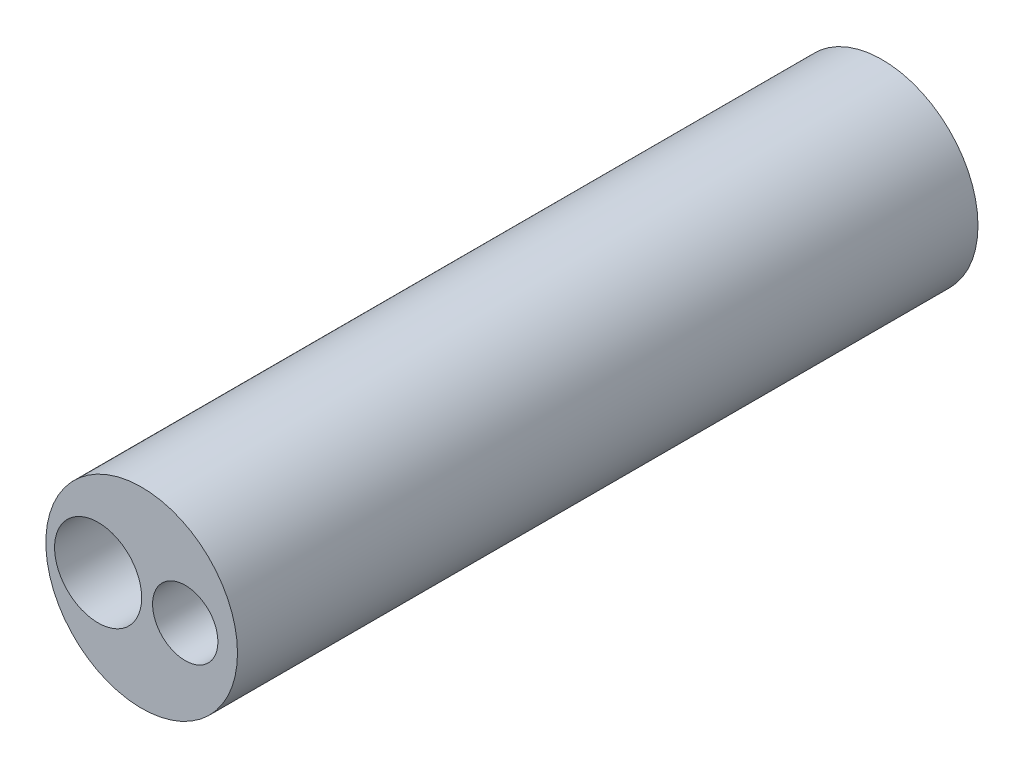
ISO-10303-21;
HEADER;
FILE_DESCRIPTION(('STEP AP214'),'2;1');
FILE_NAME('part.step','',(''),(''),'','','');
FILE_SCHEMA(('AUTOMOTIVE_DESIGN { 1 0 10303 214 1 1 1 1 }'));
ENDSEC;
DATA;
#1=APPLICATION_CONTEXT('core data for automotive mechanical design processes');
#2=APPLICATION_PROTOCOL_DEFINITION('international standard','automotive_design',2000,#1);
#3=PRODUCT_CONTEXT('',#1,'mechanical');
#4=PRODUCT('Part','Part','',(#3));
#5=PRODUCT_RELATED_PRODUCT_CATEGORY('part','',(#4));
#6=PRODUCT_DEFINITION_FORMATION('','',#4);
#7=PRODUCT_DEFINITION_CONTEXT('part definition',#1,'design');
#8=PRODUCT_DEFINITION('design','',#6,#7);
#9=PRODUCT_DEFINITION_SHAPE('','',#8);
#10=(LENGTH_UNIT() NAMED_UNIT(*) SI_UNIT(.MILLI.,.METRE.));
#11=(NAMED_UNIT(*) PLANE_ANGLE_UNIT() SI_UNIT($,.RADIAN.));
#12=(NAMED_UNIT(*) SI_UNIT($,.STERADIAN.) SOLID_ANGLE_UNIT());
#13=UNCERTAINTY_MEASURE_WITH_UNIT(LENGTH_MEASURE(1.E-05),#10,'distance_accuracy_value','');
#14=(GEOMETRIC_REPRESENTATION_CONTEXT(3) GLOBAL_UNCERTAINTY_ASSIGNED_CONTEXT((#13)) GLOBAL_UNIT_ASSIGNED_CONTEXT((#10,
#11,#12)) REPRESENTATION_CONTEXT('',''));
#15=CARTESIAN_POINT('',(0.,0.,0.));
#16=DIRECTION('',(0.,0.,1.));
#17=DIRECTION('',(1.,0.,0.));
#18=AXIS2_PLACEMENT_3D('',#15,#16,#17);
#19=CARTESIAN_POINT('',(0.,0.,0.));
#20=DIRECTION('',(0.,0.,1.));
#21=DIRECTION('',(1.,0.,0.));
#22=AXIS2_PLACEMENT_3D('',#19,#20,#21);
#23=PLANE('',#22);
#24=CARTESIAN_POINT('',(0.,0.,0.));
#25=DIRECTION('',(0.,0.,1.));
#26=DIRECTION('',(1.,0.,0.));
#27=AXIS2_PLACEMENT_3D('',#24,#25,#26);
#28=CIRCLE('',#27,5.588);
#29=CARTESIAN_POINT('',(5.588,0.,0.));
#30=VERTEX_POINT('',#29);
#31=EDGE_CURVE('E11',#30,#30,#28,.T.);
#32=ORIENTED_EDGE('',*,*,#31,.F.);
#33=EDGE_LOOP('',(#32));
#34=FACE_BOUND('',#33,.T.);
#35=CARTESIAN_POINT('',(0.,0.,0.));
#36=DIRECTION('',(0.,0.,1.));
#37=DIRECTION('',(1.,0.,0.));
#38=AXIS2_PLACEMENT_3D('',#35,#36,#37);
#39=CIRCLE('',#38,5.08);
#40=CARTESIAN_POINT('',(5.08,0.,0.));
#41=VERTEX_POINT('',#40);
#42=EDGE_CURVE('E42',#41,#41,#39,.T.);
#43=ORIENTED_EDGE('',*,*,#42,.T.);
#44=EDGE_LOOP('',(#43));
#45=FACE_BOUND('',#44,.T.);
#46=ADVANCED_FACE('F35',(#34,#45),#23,.F.);
#47=CARTESIAN_POINT('',(0.,0.,35.56));
#48=DIRECTION('',(0.,0.,-1.));
#49=DIRECTION('',(-1.,0.,0.));
#50=AXIS2_PLACEMENT_3D('',#47,#48,#49);
#51=CYLINDRICAL_SURFACE('',#50,5.588);
#52=ORIENTED_EDGE('',*,*,#31,.T.);
#53=EDGE_LOOP('',(#52));
#54=FACE_BOUND('',#53,.T.);
#55=CARTESIAN_POINT('',(0.,0.,43.18));
#56=DIRECTION('',(0.,0.,1.));
#57=DIRECTION('',(1.,0.,0.));
#58=AXIS2_PLACEMENT_3D('',#55,#56,#57);
#59=CIRCLE('',#58,5.588);
#60=CARTESIAN_POINT('',(5.588,0.,43.18));
#61=VERTEX_POINT('',#60);
#62=EDGE_CURVE('E61',#61,#61,#59,.T.);
#63=ORIENTED_EDGE('',*,*,#62,.F.);
#64=EDGE_LOOP('',(#63));
#65=FACE_BOUND('',#64,.T.);
#66=ADVANCED_FACE('F37',(#54,#65),#51,.T.);
#67=CARTESIAN_POINT('',(0.,0.,35.56));
#68=DIRECTION('',(0.,0.,-1.));
#69=DIRECTION('',(-1.,0.,0.));
#70=AXIS2_PLACEMENT_3D('',#67,#68,#69);
#71=CYLINDRICAL_SURFACE('',#70,5.08);
#72=CARTESIAN_POINT('',(0.,0.,35.56));
#73=DIRECTION('',(0.,0.,1.));
#74=DIRECTION('',(1.,0.,0.));
#75=AXIS2_PLACEMENT_3D('',#72,#73,#74);
#76=CIRCLE('',#75,5.08);
#77=CARTESIAN_POINT('',(-5.08,0.,35.56));
#78=VERTEX_POINT('',#77);
#79=EDGE_CURVE('E65',#78,#78,#76,.T.);
#80=ORIENTED_EDGE('',*,*,#79,.T.);
#81=EDGE_LOOP('',(#80));
#82=FACE_BOUND('',#81,.T.);
#83=ORIENTED_EDGE('',*,*,#42,.F.);
#84=EDGE_LOOP('',(#83));
#85=FACE_BOUND('',#84,.T.);
#86=ADVANCED_FACE('F70',(#82,#85),#71,.F.);
#87=CARTESIAN_POINT('',(0.,0.,35.56));
#88=DIRECTION('',(0.,0.,1.));
#89=DIRECTION('',(1.,0.,0.));
#90=AXIS2_PLACEMENT_3D('',#87,#88,#89);
#91=PLANE('',#90);
#92=CARTESIAN_POINT('',(2.54,0.,35.56));
#93=DIRECTION('',(0.,0.,1.));
#94=DIRECTION('',(1.,0.,0.));
#95=AXIS2_PLACEMENT_3D('',#92,#93,#94);
#96=CIRCLE('',#95,1.905);
#97=CARTESIAN_POINT('',(4.445,0.,35.56));
#98=VERTEX_POINT('',#97);
#99=EDGE_CURVE('E51',#98,#98,#96,.T.);
#100=ORIENTED_EDGE('',*,*,#99,.T.);
#101=EDGE_LOOP('',(#100));
#102=FACE_BOUND('',#101,.T.);
#103=ORIENTED_EDGE('',*,*,#79,.F.);
#104=CARTESIAN_POINT('',(-2.54,0.,35.56));
#105=DIRECTION('',(0.,0.,1.));
#106=DIRECTION('',(1.,0.,0.));
#107=AXIS2_PLACEMENT_3D('',#104,#105,#106);
#108=CIRCLE('',#107,2.54);
#109=EDGE_CURVE('E46',#78,#78,#108,.T.);
#110=ORIENTED_EDGE('',*,*,#109,.T.);
#111=EDGE_LOOP('',(#103,#110));
#112=FACE_BOUND('',#111,.T.);
#113=ADVANCED_FACE('F72',(#102,#112),#91,.F.);
#114=CARTESIAN_POINT('',(0.,0.,43.18));
#115=DIRECTION('',(0.,0.,1.));
#116=DIRECTION('',(1.,0.,0.));
#117=AXIS2_PLACEMENT_3D('',#114,#115,#116);
#118=PLANE('',#117);
#119=CARTESIAN_POINT('',(-2.54,0.,43.18));
#120=DIRECTION('',(0.,0.,1.));
#121=DIRECTION('',(1.,0.,0.));
#122=AXIS2_PLACEMENT_3D('',#119,#120,#121);
#123=CIRCLE('',#122,2.54);
#124=CARTESIAN_POINT('',(0.,0.,43.18));
#125=VERTEX_POINT('',#124);
#126=EDGE_CURVE('E52',#125,#125,#123,.T.);
#127=ORIENTED_EDGE('',*,*,#126,.F.);
#128=EDGE_LOOP('',(#127));
#129=FACE_BOUND('',#128,.T.);
#130=ORIENTED_EDGE('',*,*,#62,.T.);
#131=EDGE_LOOP('',(#130));
#132=FACE_BOUND('',#131,.T.);
#133=CARTESIAN_POINT('',(2.54,0.,43.18));
#134=DIRECTION('',(0.,0.,1.));
#135=DIRECTION('',(1.,0.,0.));
#136=AXIS2_PLACEMENT_3D('',#133,#134,#135);
#137=CIRCLE('',#136,1.905);
#138=CARTESIAN_POINT('',(4.445,0.,43.18));
#139=VERTEX_POINT('',#138);
#140=EDGE_CURVE('E55',#139,#139,#137,.T.);
#141=ORIENTED_EDGE('',*,*,#140,.F.);
#142=EDGE_LOOP('',(#141));
#143=FACE_BOUND('',#142,.T.);
#144=ADVANCED_FACE('F79',(#129,#132,#143),#118,.T.);
#145=CARTESIAN_POINT('',(2.54,0.,43.18));
#146=DIRECTION('',(0.,0.,-1.));
#147=DIRECTION('',(-1.,0.,0.));
#148=AXIS2_PLACEMENT_3D('',#145,#146,#147);
#149=CYLINDRICAL_SURFACE('',#148,1.905);
#150=ORIENTED_EDGE('',*,*,#140,.T.);
#151=EDGE_LOOP('',(#150));
#152=FACE_BOUND('',#151,.T.);
#153=ORIENTED_EDGE('',*,*,#99,.F.);
#154=EDGE_LOOP('',(#153));
#155=FACE_BOUND('',#154,.T.);
#156=ADVANCED_FACE('F93',(#152,#155),#149,.F.);
#157=CARTESIAN_POINT('',(-2.54,0.,10.16));
#158=DIRECTION('',(0.,0.,1.));
#159=DIRECTION('',(1.,0.,0.));
#160=AXIS2_PLACEMENT_3D('',#157,#158,#159);
#161=CYLINDRICAL_SURFACE('',#160,2.54);
#162=ORIENTED_EDGE('',*,*,#126,.T.);
#163=EDGE_LOOP('',(#162));
#164=FACE_BOUND('',#163,.T.);
#165=ORIENTED_EDGE('',*,*,#109,.F.);
#166=EDGE_LOOP('',(#165));
#167=FACE_BOUND('',#166,.T.);
#168=ADVANCED_FACE('F47',(#164,#167),#161,.F.);
#169=CLOSED_SHELL('',(#46,#66,#86,#113,#144,#156,#168));
#170=MANIFOLD_SOLID_BREP('B2',#169);
#171=ADVANCED_BREP_SHAPE_REPRESENTATION('',(#18,#170),#14);
#172=SHAPE_DEFINITION_REPRESENTATION(#9,#171);
ENDSEC;
END-ISO-10303-21;
